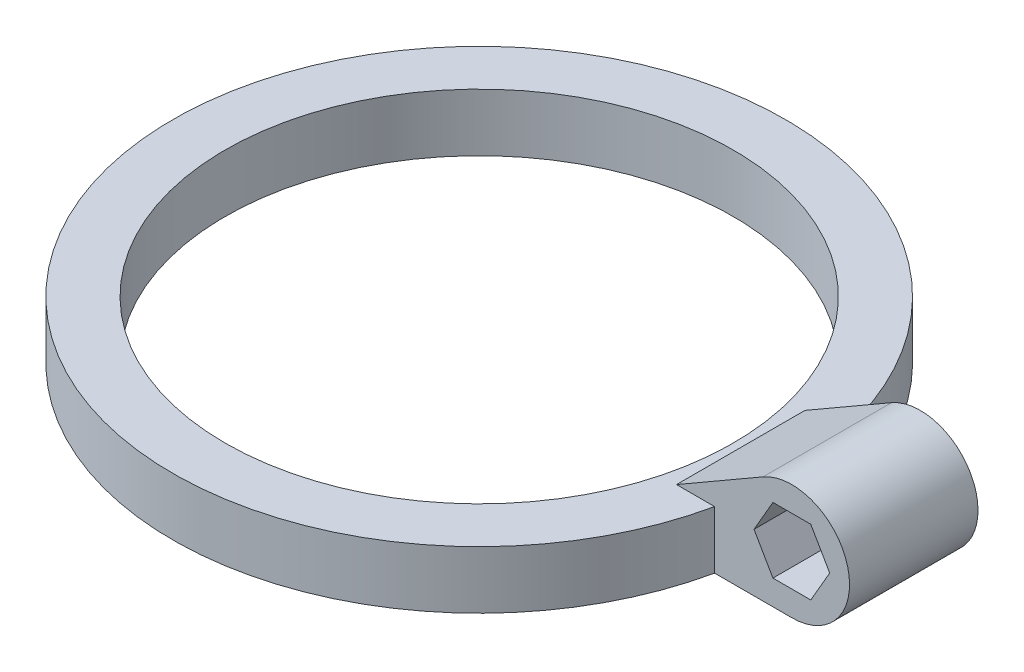
ISO-10303-21;
HEADER;
FILE_DESCRIPTION(('STEP AP214'),'2;1');
FILE_NAME('part.step','',(''),(''),'','','');
FILE_SCHEMA(('AUTOMOTIVE_DESIGN { 1 0 10303 214 1 1 1 1 }'));
ENDSEC;
DATA;
#1=APPLICATION_CONTEXT('core data for automotive mechanical design processes');
#2=APPLICATION_PROTOCOL_DEFINITION('international standard','automotive_design',2000,#1);
#3=PRODUCT_CONTEXT('',#1,'mechanical');
#4=PRODUCT('Part','Part','',(#3));
#5=PRODUCT_RELATED_PRODUCT_CATEGORY('part','',(#4));
#6=PRODUCT_DEFINITION_FORMATION('','',#4);
#7=PRODUCT_DEFINITION_CONTEXT('part definition',#1,'design');
#8=PRODUCT_DEFINITION('design','',#6,#7);
#9=PRODUCT_DEFINITION_SHAPE('','',#8);
#10=(LENGTH_UNIT() NAMED_UNIT(*) SI_UNIT(.MILLI.,.METRE.));
#11=(NAMED_UNIT(*) PLANE_ANGLE_UNIT() SI_UNIT($,.RADIAN.));
#12=(NAMED_UNIT(*) SI_UNIT($,.STERADIAN.) SOLID_ANGLE_UNIT());
#13=UNCERTAINTY_MEASURE_WITH_UNIT(LENGTH_MEASURE(1.E-05),#10,'distance_accuracy_value','');
#14=(GEOMETRIC_REPRESENTATION_CONTEXT(3) GLOBAL_UNCERTAINTY_ASSIGNED_CONTEXT((#13)) GLOBAL_UNIT_ASSIGNED_CONTEXT((#10,
#11,#12)) REPRESENTATION_CONTEXT('',''));
#15=CARTESIAN_POINT('',(0.,0.,0.));
#16=DIRECTION('',(0.,0.,1.));
#17=DIRECTION('',(1.,0.,0.));
#18=AXIS2_PLACEMENT_3D('',#15,#16,#17);
#19=CARTESIAN_POINT('',(-11.7887048969295,-8.8,-9.8));
#20=DIRECTION('',(0.,0.,-1.));
#21=DIRECTION('',(-1.,0.,0.));
#22=AXIS2_PLACEMENT_3D('',#19,#20,#21);
#23=PLANE('',#22);
#24=DIRECTION('',(0.,1.,0.));
#25=VECTOR('',#24,1.);
#26=CARTESIAN_POINT('',(1.,-5.,-9.8));
#27=LINE('',#26,#25);
#28=CARTESIAN_POINT('',(1.,-6.,-9.8));
#29=VERTEX_POINT('',#28);
#30=CARTESIAN_POINT('',(1.,-5.,-9.8));
#31=VERTEX_POINT('',#30);
#32=EDGE_CURVE('E148',#29,#31,#27,.T.);
#33=ORIENTED_EDGE('',*,*,#32,.T.);
#34=DIRECTION('',(1.,0.,0.));
#35=VECTOR('',#34,1.);
#36=CARTESIAN_POINT('',(-2.88675134594812,-5.,-9.8));
#37=LINE('',#36,#35);
#38=CARTESIAN_POINT('',(2.88675134594813,-5.,-9.8));
#39=VERTEX_POINT('',#38);
#40=EDGE_CURVE('E60',#31,#39,#37,.T.);
#41=ORIENTED_EDGE('',*,*,#40,.T.);
#42=DIRECTION('',(0.5,0.866025403784439,0.));
#43=VECTOR('',#42,1.);
#44=CARTESIAN_POINT('',(2.88675134594813,-4.99999999999999,-9.8));
#45=LINE('',#44,#43);
#46=CARTESIAN_POINT('',(5.77350269189626,0.,-9.8));
#47=VERTEX_POINT('',#46);
#48=EDGE_CURVE('E170',#39,#47,#45,.T.);
#49=ORIENTED_EDGE('',*,*,#48,.T.);
#50=DIRECTION('',(-0.5,0.866025403784438,0.));
#51=VECTOR('',#50,1.);
#52=CARTESIAN_POINT('',(5.77350269189626,0.,-9.8));
#53=LINE('',#52,#51);
#54=CARTESIAN_POINT('',(2.88675134594813,5.,-9.8));
#55=VERTEX_POINT('',#54);
#56=EDGE_CURVE('E177',#47,#55,#53,.T.);
#57=ORIENTED_EDGE('',*,*,#56,.T.);
#58=DIRECTION('',(-1.,0.,0.));
#59=VECTOR('',#58,1.);
#60=CARTESIAN_POINT('',(2.88675134594814,5.,-9.8));
#61=LINE('',#60,#59);
#62=CARTESIAN_POINT('',(-2.88675134594813,5.,-9.8));
#63=VERTEX_POINT('',#62);
#64=EDGE_CURVE('E436',#55,#63,#61,.T.);
#65=ORIENTED_EDGE('',*,*,#64,.T.);
#66=DIRECTION('',(-0.5,-0.866025403784439,0.));
#67=VECTOR('',#66,1.);
#68=CARTESIAN_POINT('',(-2.88675134594813,5.00000000000001,-9.8));
#69=LINE('',#68,#67);
#70=CARTESIAN_POINT('',(-5.77350269189626,0.,-9.8));
#71=VERTEX_POINT('',#70);
#72=EDGE_CURVE('E172',#63,#71,#69,.T.);
#73=ORIENTED_EDGE('',*,*,#72,.T.);
#74=DIRECTION('',(0.5,-0.866025403784439,0.));
#75=VECTOR('',#74,1.);
#76=CARTESIAN_POINT('',(-5.77350269189626,0.,-9.8));
#77=LINE('',#76,#75);
#78=CARTESIAN_POINT('',(-2.88675134594813,-5.,-9.8));
#79=VERTEX_POINT('',#78);
#80=EDGE_CURVE('E167',#71,#79,#77,.T.);
#81=ORIENTED_EDGE('',*,*,#80,.T.);
#82=CARTESIAN_POINT('',(-1.,-5.,-9.8));
#83=VERTEX_POINT('',#82);
#84=EDGE_CURVE('E166',#79,#83,#37,.T.);
#85=ORIENTED_EDGE('',*,*,#84,.T.);
#86=DIRECTION('',(0.,-1.,0.));
#87=VECTOR('',#86,1.);
#88=CARTESIAN_POINT('',(-0.999999999999998,-6.,-9.8));
#89=LINE('',#88,#87);
#90=CARTESIAN_POINT('',(-0.999999999999998,-6.,-9.8));
#91=VERTEX_POINT('',#90);
#92=EDGE_CURVE('E450',#83,#91,#89,.T.);
#93=ORIENTED_EDGE('',*,*,#92,.T.);
#94=DIRECTION('',(1.,0.,0.));
#95=VECTOR('',#94,1.);
#96=CARTESIAN_POINT('',(1.00000000000001,-6.,-9.8));
#97=LINE('',#96,#95);
#98=EDGE_CURVE('E160',#91,#29,#97,.T.);
#99=ORIENTED_EDGE('',*,*,#98,.T.);
#100=EDGE_LOOP('',(#33,#41,#49,#57,#65,#73,#81,#85,#93,#99));
#101=FACE_BOUND('',#100,.T.);
#102=DIRECTION('',(0.,1.,0.));
#103=VECTOR('',#102,1.);
#104=CARTESIAN_POINT('',(-11.7887048969295,-8.8,-9.79999999999999));
#105=LINE('',#104,#103);
#106=CARTESIAN_POINT('',(-11.7887048969295,-8.8,-9.79999999999999));
#107=VERTEX_POINT('',#106);
#108=CARTESIAN_POINT('',(-11.7887048969295,0.,-9.79999999999999));
#109=VERTEX_POINT('',#108);
#110=EDGE_CURVE('E41',#107,#109,#105,.T.);
#111=ORIENTED_EDGE('',*,*,#110,.T.);
#112=DIRECTION('',(1.,0.,0.));
#113=VECTOR('',#112,1.);
#114=CARTESIAN_POINT('',(0.,0.,-9.8));
#115=LINE('',#114,#113);
#116=CARTESIAN_POINT('',(-17.6000000000002,0.,-9.8));
#117=VERTEX_POINT('',#116);
#118=EDGE_CURVE('E216',#117,#109,#115,.T.);
#119=ORIENTED_EDGE('',*,*,#118,.F.);
#120=DIRECTION('',(-0.866025403784441,-0.499999999999995,0.));
#121=VECTOR('',#120,1.);
#122=CARTESIAN_POINT('',(-17.6000000000002,0.,-9.8));
#123=LINE('',#122,#121);
#124=CARTESIAN_POINT('',(-4.39999999999996,7.62102355330309,-9.8));
#125=VERTEX_POINT('',#124);
#126=EDGE_CURVE('E221',#125,#117,#123,.T.);
#127=ORIENTED_EDGE('',*,*,#126,.F.);
#128=CARTESIAN_POINT('',(0.,0.,-9.8));
#129=DIRECTION('',(0.,0.,1.));
#130=DIRECTION('',(1.,0.,0.));
#131=AXIS2_PLACEMENT_3D('',#128,#129,#130);
#132=CIRCLE('',#131,8.8);
#133=CARTESIAN_POINT('',(0.,-8.8,-9.8));
#134=VERTEX_POINT('',#133);
#135=EDGE_CURVE('E218',#134,#125,#132,.T.);
#136=ORIENTED_EDGE('',*,*,#135,.F.);
#137=DIRECTION('',(-1.,0.,0.));
#138=VECTOR('',#137,1.);
#139=CARTESIAN_POINT('',(-11.7887048969295,-8.8,-9.8));
#140=LINE('',#139,#138);
#141=EDGE_CURVE('E236',#134,#107,#140,.T.);
#142=ORIENTED_EDGE('',*,*,#141,.T.);
#143=EDGE_LOOP('',(#111,#119,#127,#136,#142));
#144=FACE_BOUND('',#143,.T.);
#145=ADVANCED_FACE('F38',(#101,#144),#23,.T.);
#146=CARTESIAN_POINT('',(-11.7887048969295,-8.8,9.8));
#147=DIRECTION('',(0.,0.,1.));
#148=DIRECTION('',(1.,0.,0.));
#149=AXIS2_PLACEMENT_3D('',#146,#147,#148);
#150=PLANE('',#149);
#151=DIRECTION('',(1.,0.,0.));
#152=VECTOR('',#151,1.);
#153=CARTESIAN_POINT('',(-11.7887048969295,-8.8,9.8));
#154=LINE('',#153,#152);
#155=CARTESIAN_POINT('',(-11.7887048969295,-8.8,9.8));
#156=VERTEX_POINT('',#155);
#157=CARTESIAN_POINT('',(0.,-8.8,9.8));
#158=VERTEX_POINT('',#157);
#159=EDGE_CURVE('E242',#156,#158,#154,.T.);
#160=ORIENTED_EDGE('',*,*,#159,.T.);
#161=CARTESIAN_POINT('',(0.,0.,9.8));
#162=DIRECTION('',(0.,0.,1.));
#163=DIRECTION('',(1.,0.,0.));
#164=AXIS2_PLACEMENT_3D('',#161,#162,#163);
#165=CIRCLE('',#164,8.8);
#166=CARTESIAN_POINT('',(-4.39999999999996,7.62102355330309,9.8));
#167=VERTEX_POINT('',#166);
#168=EDGE_CURVE('E210',#158,#167,#165,.T.);
#169=ORIENTED_EDGE('',*,*,#168,.T.);
#170=DIRECTION('',(-0.866025403784441,-0.499999999999995,0.));
#171=VECTOR('',#170,1.);
#172=CARTESIAN_POINT('',(-17.6000000000002,0.,9.8));
#173=LINE('',#172,#171);
#174=CARTESIAN_POINT('',(-17.6000000000002,0.,9.8));
#175=VERTEX_POINT('',#174);
#176=EDGE_CURVE('E213',#167,#175,#173,.T.);
#177=ORIENTED_EDGE('',*,*,#176,.T.);
#178=DIRECTION('',(1.,0.,0.));
#179=VECTOR('',#178,1.);
#180=CARTESIAN_POINT('',(0.,0.,9.8));
#181=LINE('',#180,#179);
#182=CARTESIAN_POINT('',(-11.7887048969295,0.,9.8));
#183=VERTEX_POINT('',#182);
#184=EDGE_CURVE('E207',#175,#183,#181,.T.);
#185=ORIENTED_EDGE('',*,*,#184,.T.);
#186=DIRECTION('',(0.,1.,0.));
#187=VECTOR('',#186,1.);
#188=CARTESIAN_POINT('',(-11.7887048969295,-8.8,9.8));
#189=LINE('',#188,#187);
#190=EDGE_CURVE('E11',#156,#183,#189,.T.);
#191=ORIENTED_EDGE('',*,*,#190,.F.);
#192=EDGE_LOOP('',(#160,#169,#177,#185,#191));
#193=FACE_BOUND('',#192,.T.);
#194=DIRECTION('',(-0.5,0.866025403784439,0.));
#195=VECTOR('',#194,1.);
#196=CARTESIAN_POINT('',(5.77350269189626,0.,9.8));
#197=LINE('',#196,#195);
#198=CARTESIAN_POINT('',(5.77350269189626,0.,9.8));
#199=VERTEX_POINT('',#198);
#200=CARTESIAN_POINT('',(2.88675134594813,5.,9.8));
#201=VERTEX_POINT('',#200);
#202=EDGE_CURVE('E188',#199,#201,#197,.T.);
#203=ORIENTED_EDGE('',*,*,#202,.F.);
#204=DIRECTION('',(0.5,0.866025403784439,0.));
#205=VECTOR('',#204,1.);
#206=CARTESIAN_POINT('',(2.88675134594813,-5.,9.8));
#207=LINE('',#206,#205);
#208=CARTESIAN_POINT('',(2.88675134594813,-5.,9.8));
#209=VERTEX_POINT('',#208);
#210=EDGE_CURVE('E191',#209,#199,#207,.T.);
#211=ORIENTED_EDGE('',*,*,#210,.F.);
#212=DIRECTION('',(1.,0.,0.));
#213=VECTOR('',#212,1.);
#214=CARTESIAN_POINT('',(-2.88675134594813,-5.,9.8));
#215=LINE('',#214,#213);
#216=CARTESIAN_POINT('',(-2.88675134594813,-5.,9.8));
#217=VERTEX_POINT('',#216);
#218=EDGE_CURVE('E205',#217,#209,#215,.T.);
#219=ORIENTED_EDGE('',*,*,#218,.F.);
#220=DIRECTION('',(0.5,-0.866025403784439,0.));
#221=VECTOR('',#220,1.);
#222=CARTESIAN_POINT('',(-5.77350269189626,0.,9.8));
#223=LINE('',#222,#221);
#224=CARTESIAN_POINT('',(-5.77350269189626,0.,9.8));
#225=VERTEX_POINT('',#224);
#226=EDGE_CURVE('E180',#225,#217,#223,.T.);
#227=ORIENTED_EDGE('',*,*,#226,.F.);
#228=DIRECTION('',(-0.5,-0.866025403784439,0.));
#229=VECTOR('',#228,1.);
#230=CARTESIAN_POINT('',(-2.88675134594813,5.,9.8));
#231=LINE('',#230,#229);
#232=CARTESIAN_POINT('',(-2.88675134594813,5.,9.8));
#233=VERTEX_POINT('',#232);
#234=EDGE_CURVE('E182',#233,#225,#231,.T.);
#235=ORIENTED_EDGE('',*,*,#234,.F.);
#236=DIRECTION('',(-1.,0.,0.));
#237=VECTOR('',#236,1.);
#238=CARTESIAN_POINT('',(2.88675134594813,5.,9.8));
#239=LINE('',#238,#237);
#240=EDGE_CURVE('E185',#201,#233,#239,.T.);
#241=ORIENTED_EDGE('',*,*,#240,.F.);
#242=EDGE_LOOP('',(#203,#211,#219,#227,#235,#241));
#243=FACE_BOUND('',#242,.T.);
#244=ADVANCED_FACE('F255',(#193,#243),#150,.T.);
#245=CARTESIAN_POINT('',(-57.5,0.,0.));
#246=DIRECTION('',(0.,1.,0.));
#247=DIRECTION('',(0.,0.,1.));
#248=AXIS2_PLACEMENT_3D('',#245,#246,#247);
#249=PLANE('',#248);
#250=CARTESIAN_POINT('',(-57.5,0.,0.));
#251=DIRECTION('',(0.,1.,0.));
#252=DIRECTION('',(0.,0.,1.));
#253=AXIS2_PLACEMENT_3D('',#250,#251,#252);
#254=CIRCLE('',#253,38.75);
#255=CARTESIAN_POINT('',(-57.5,0.,38.75));
#256=VERTEX_POINT('',#255);
#257=EDGE_CURVE('E228',#256,#256,#254,.T.);
#258=ORIENTED_EDGE('',*,*,#257,.F.);
#259=EDGE_LOOP('',(#258));
#260=FACE_BOUND('',#259,.T.);
#261=DIRECTION('',(0.,0.,1.));
#262=VECTOR('',#261,1.);
#263=CARTESIAN_POINT('',(-17.6000000000002,0.,-9.8));
#264=LINE('',#263,#262);
#265=EDGE_CURVE('E225',#117,#175,#264,.T.);
#266=ORIENTED_EDGE('',*,*,#265,.F.);
#267=ORIENTED_EDGE('',*,*,#118,.T.);
#268=CARTESIAN_POINT('',(-57.5,0.,0.));
#269=DIRECTION('',(0.,1.,0.));
#270=DIRECTION('',(0.,0.,1.));
#271=AXIS2_PLACEMENT_3D('',#268,#269,#270);
#272=CIRCLE('',#271,46.75);
#273=EDGE_CURVE('E233',#109,#183,#272,.T.);
#274=ORIENTED_EDGE('',*,*,#273,.T.);
#275=ORIENTED_EDGE('',*,*,#184,.F.);
#276=EDGE_LOOP('',(#266,#267,#274,#275));
#277=FACE_BOUND('',#276,.T.);
#278=ADVANCED_FACE('F250',(#260,#277),#249,.T.);
#279=CARTESIAN_POINT('',(-57.5,-8.8,0.));
#280=DIRECTION('',(0.,1.,0.));
#281=DIRECTION('',(0.,0.,1.));
#282=AXIS2_PLACEMENT_3D('',#279,#280,#281);
#283=CYLINDRICAL_SURFACE('',#282,46.75);
#284=ORIENTED_EDGE('',*,*,#273,.F.);
#285=ORIENTED_EDGE('',*,*,#110,.F.);
#286=CARTESIAN_POINT('',(-57.5,-8.8,0.));
#287=DIRECTION('',(0.,1.,0.));
#288=DIRECTION('',(0.,0.,1.));
#289=AXIS2_PLACEMENT_3D('',#286,#287,#288);
#290=CIRCLE('',#289,46.75);
#291=EDGE_CURVE('E239',#107,#156,#290,.T.);
#292=ORIENTED_EDGE('',*,*,#291,.T.);
#293=ORIENTED_EDGE('',*,*,#190,.T.);
#294=EDGE_LOOP('',(#284,#285,#292,#293));
#295=FACE_BOUND('',#294,.T.);
#296=ADVANCED_FACE('F265',(#295),#283,.T.);
#297=CARTESIAN_POINT('',(-57.5,-8.8,0.));
#298=DIRECTION('',(0.,1.,0.));
#299=DIRECTION('',(0.,0.,1.));
#300=AXIS2_PLACEMENT_3D('',#297,#298,#299);
#301=PLANE('',#300);
#302=CARTESIAN_POINT('',(-57.5,-8.8,0.));
#303=DIRECTION('',(0.,1.,0.));
#304=DIRECTION('',(0.,0.,1.));
#305=AXIS2_PLACEMENT_3D('',#302,#303,#304);
#306=CIRCLE('',#305,38.75);
#307=CARTESIAN_POINT('',(-57.5,-8.8,38.75));
#308=VERTEX_POINT('',#307);
#309=EDGE_CURVE('E230',#308,#308,#306,.T.);
#310=ORIENTED_EDGE('',*,*,#309,.T.);
#311=EDGE_LOOP('',(#310));
#312=FACE_BOUND('',#311,.T.);
#313=ORIENTED_EDGE('',*,*,#141,.F.);
#314=DIRECTION('',(0.,0.,-1.));
#315=VECTOR('',#314,1.);
#316=CARTESIAN_POINT('',(0.,-8.8,9.8));
#317=LINE('',#316,#315);
#318=EDGE_CURVE('E244',#158,#134,#317,.T.);
#319=ORIENTED_EDGE('',*,*,#318,.F.);
#320=ORIENTED_EDGE('',*,*,#159,.F.);
#321=ORIENTED_EDGE('',*,*,#291,.F.);
#322=EDGE_LOOP('',(#313,#319,#320,#321));
#323=FACE_BOUND('',#322,.T.);
#324=ADVANCED_FACE('F267',(#312,#323),#301,.F.);
#325=CARTESIAN_POINT('',(-57.5,-8.8,0.));
#326=DIRECTION('',(0.,1.,0.));
#327=DIRECTION('',(0.,0.,1.));
#328=AXIS2_PLACEMENT_3D('',#325,#326,#327);
#329=CYLINDRICAL_SURFACE('',#328,38.75);
#330=ORIENTED_EDGE('',*,*,#309,.F.);
#331=EDGE_LOOP('',(#330));
#332=FACE_BOUND('',#331,.T.);
#333=ORIENTED_EDGE('',*,*,#257,.T.);
#334=EDGE_LOOP('',(#333));
#335=FACE_BOUND('',#334,.T.);
#336=ADVANCED_FACE('F281',(#332,#335),#329,.F.);
#337=CARTESIAN_POINT('',(-17.6000000000002,0.,-9.8));
#338=DIRECTION('',(-0.499999999999995,0.866025403784441,0.));
#339=DIRECTION('',(-0.866025403784441,-0.499999999999995,0.));
#340=AXIS2_PLACEMENT_3D('',#337,#338,#339);
#341=PLANE('',#340);
#342=ORIENTED_EDGE('',*,*,#265,.T.);
#343=ORIENTED_EDGE('',*,*,#176,.F.);
#344=DIRECTION('',(0.,0.,1.));
#345=VECTOR('',#344,1.);
#346=CARTESIAN_POINT('',(-4.39999999999996,7.62102355330309,-9.8));
#347=LINE('',#346,#345);
#348=EDGE_CURVE('E224',#125,#167,#347,.T.);
#349=ORIENTED_EDGE('',*,*,#348,.F.);
#350=ORIENTED_EDGE('',*,*,#126,.T.);
#351=EDGE_LOOP('',(#342,#343,#349,#350));
#352=FACE_BOUND('',#351,.T.);
#353=ADVANCED_FACE('F261',(#352),#341,.T.);
#354=CARTESIAN_POINT('',(0.,0.,-9.8));
#355=DIRECTION('',(0.,0.,1.));
#356=DIRECTION('',(1.,0.,0.));
#357=AXIS2_PLACEMENT_3D('',#354,#355,#356);
#358=CYLINDRICAL_SURFACE('',#357,8.8);
#359=ORIENTED_EDGE('',*,*,#348,.T.);
#360=ORIENTED_EDGE('',*,*,#168,.F.);
#361=ORIENTED_EDGE('',*,*,#318,.T.);
#362=ORIENTED_EDGE('',*,*,#135,.T.);
#363=EDGE_LOOP('',(#359,#360,#361,#362));
#364=FACE_BOUND('',#363,.T.);
#365=ADVANCED_FACE('F270',(#364),#358,.T.);
#366=CARTESIAN_POINT('',(2.88675134594813,-5.,46.751));
#367=DIRECTION('',(-0.866025403784439,0.5,0.));
#368=DIRECTION('',(-0.5,-0.866025403784439,0.));
#369=AXIS2_PLACEMENT_3D('',#366,#367,#368);
#370=PLANE('',#369);
#371=ORIENTED_EDGE('',*,*,#210,.T.);
#372=DIRECTION('',(0.,0.,-1.));
#373=VECTOR('',#372,1.);
#374=CARTESIAN_POINT('',(5.77350269189626,0.,46.751));
#375=LINE('',#374,#373);
#376=EDGE_CURVE('E203',#199,#47,#375,.T.);
#377=ORIENTED_EDGE('',*,*,#376,.T.);
#378=ORIENTED_EDGE('',*,*,#48,.F.);
#379=DIRECTION('',(0.,0.,-1.));
#380=VECTOR('',#379,1.);
#381=CARTESIAN_POINT('',(2.88675134594813,-5.,46.751));
#382=LINE('',#381,#380);
#383=EDGE_CURVE('E165',#209,#39,#382,.T.);
#384=ORIENTED_EDGE('',*,*,#383,.F.);
#385=EDGE_LOOP('',(#371,#377,#378,#384));
#386=FACE_BOUND('',#385,.T.);
#387=ADVANCED_FACE('F272',(#386),#370,.T.);
#388=CARTESIAN_POINT('',(5.77350269189626,0.,46.751));
#389=DIRECTION('',(-0.866025403784438,-0.5,0.));
#390=DIRECTION('',(0.5,-0.866025403784439,0.));
#391=AXIS2_PLACEMENT_3D('',#388,#389,#390);
#392=PLANE('',#391);
#393=ORIENTED_EDGE('',*,*,#202,.T.);
#394=DIRECTION('',(0.,0.,-1.));
#395=VECTOR('',#394,1.);
#396=CARTESIAN_POINT('',(2.88675134594813,5.,46.751));
#397=LINE('',#396,#395);
#398=EDGE_CURVE('E201',#201,#55,#397,.T.);
#399=ORIENTED_EDGE('',*,*,#398,.T.);
#400=ORIENTED_EDGE('',*,*,#56,.F.);
#401=ORIENTED_EDGE('',*,*,#376,.F.);
#402=EDGE_LOOP('',(#393,#399,#400,#401));
#403=FACE_BOUND('',#402,.T.);
#404=ADVANCED_FACE('F278',(#403),#392,.T.);
#405=CARTESIAN_POINT('',(2.88675134594813,5.,46.751));
#406=DIRECTION('',(0.,-1.,0.));
#407=DIRECTION('',(0.,0.,-1.));
#408=AXIS2_PLACEMENT_3D('',#405,#406,#407);
#409=PLANE('',#408);
#410=ORIENTED_EDGE('',*,*,#240,.T.);
#411=DIRECTION('',(0.,0.,-1.));
#412=VECTOR('',#411,1.);
#413=CARTESIAN_POINT('',(-2.88675134594813,5.,46.751));
#414=LINE('',#413,#412);
#415=EDGE_CURVE('E199',#233,#63,#414,.T.);
#416=ORIENTED_EDGE('',*,*,#415,.T.);
#417=ORIENTED_EDGE('',*,*,#64,.F.);
#418=ORIENTED_EDGE('',*,*,#398,.F.);
#419=EDGE_LOOP('',(#410,#416,#417,#418));
#420=FACE_BOUND('',#419,.T.);
#421=ADVANCED_FACE('F343',(#420),#409,.T.);
#422=CARTESIAN_POINT('',(-2.88675134594813,5.,46.751));
#423=DIRECTION('',(0.866025403784438,-0.5,0.));
#424=DIRECTION('',(0.5,0.866025403784439,0.));
#425=AXIS2_PLACEMENT_3D('',#422,#423,#424);
#426=PLANE('',#425);
#427=ORIENTED_EDGE('',*,*,#234,.T.);
#428=DIRECTION('',(0.,0.,-1.));
#429=VECTOR('',#428,1.);
#430=CARTESIAN_POINT('',(-5.77350269189626,0.,46.751));
#431=LINE('',#430,#429);
#432=EDGE_CURVE('E197',#225,#71,#431,.T.);
#433=ORIENTED_EDGE('',*,*,#432,.T.);
#434=ORIENTED_EDGE('',*,*,#72,.F.);
#435=ORIENTED_EDGE('',*,*,#415,.F.);
#436=EDGE_LOOP('',(#427,#433,#434,#435));
#437=FACE_BOUND('',#436,.T.);
#438=ADVANCED_FACE('F353',(#437),#426,.T.);
#439=CARTESIAN_POINT('',(-5.77350269189626,0.,46.751));
#440=DIRECTION('',(0.866025403784438,0.5,0.));
#441=DIRECTION('',(-0.5,0.866025403784439,0.));
#442=AXIS2_PLACEMENT_3D('',#439,#440,#441);
#443=PLANE('',#442);
#444=ORIENTED_EDGE('',*,*,#226,.T.);
#445=DIRECTION('',(0.,0.,-1.));
#446=VECTOR('',#445,1.);
#447=CARTESIAN_POINT('',(-2.88675134594813,-5.,46.751));
#448=LINE('',#447,#446);
#449=EDGE_CURVE('E195',#217,#79,#448,.T.);
#450=ORIENTED_EDGE('',*,*,#449,.T.);
#451=ORIENTED_EDGE('',*,*,#80,.F.);
#452=ORIENTED_EDGE('',*,*,#432,.F.);
#453=EDGE_LOOP('',(#444,#450,#451,#452));
#454=FACE_BOUND('',#453,.T.);
#455=ADVANCED_FACE('F363',(#454),#443,.T.);
#456=CARTESIAN_POINT('',(-2.88675134594813,-5.,46.751));
#457=DIRECTION('',(0.,1.,0.));
#458=DIRECTION('',(-1.,0.,0.));
#459=AXIS2_PLACEMENT_3D('',#456,#457,#458);
#460=PLANE('',#459);
#461=DIRECTION('',(0.,0.,1.));
#462=VECTOR('',#461,1.);
#463=CARTESIAN_POINT('',(1.,-5.,-46.751));
#464=LINE('',#463,#462);
#465=CARTESIAN_POINT('',(1.,-5.,0.));
#466=VERTEX_POINT('',#465);
#467=EDGE_CURVE('E146',#31,#466,#464,.T.);
#468=ORIENTED_EDGE('',*,*,#467,.T.);
#469=DIRECTION('',(-1.,0.,0.));
#470=VECTOR('',#469,1.);
#471=CARTESIAN_POINT('',(-1.,-5.,0.));
#472=LINE('',#471,#470);
#473=CARTESIAN_POINT('',(-1.,-5.,0.));
#474=VERTEX_POINT('',#473);
#475=EDGE_CURVE('E426',#466,#474,#472,.T.);
#476=ORIENTED_EDGE('',*,*,#475,.T.);
#477=DIRECTION('',(0.,0.,1.));
#478=VECTOR('',#477,1.);
#479=CARTESIAN_POINT('',(-1.,-5.,-46.751));
#480=LINE('',#479,#478);
#481=EDGE_CURVE('E154',#83,#474,#480,.T.);
#482=ORIENTED_EDGE('',*,*,#481,.F.);
#483=ORIENTED_EDGE('',*,*,#84,.F.);
#484=ORIENTED_EDGE('',*,*,#449,.F.);
#485=ORIENTED_EDGE('',*,*,#218,.T.);
#486=ORIENTED_EDGE('',*,*,#383,.T.);
#487=ORIENTED_EDGE('',*,*,#40,.F.);
#488=EDGE_LOOP('',(#468,#476,#482,#483,#484,#485,#486,#487));
#489=FACE_BOUND('',#488,.T.);
#490=ADVANCED_FACE('F163',(#489),#460,.T.);
#491=CARTESIAN_POINT('',(1.,-5.,-46.751));
#492=DIRECTION('',(1.,0.,0.));
#493=DIRECTION('',(0.,0.,-1.));
#494=AXIS2_PLACEMENT_3D('',#491,#492,#493);
#495=PLANE('',#494);
#496=DIRECTION('',(0.,0.,1.));
#497=VECTOR('',#496,1.);
#498=CARTESIAN_POINT('',(1.,-6.,-46.751));
#499=LINE('',#498,#497);
#500=CARTESIAN_POINT('',(1.,-6.,0.));
#501=VERTEX_POINT('',#500);
#502=EDGE_CURVE('E428',#29,#501,#499,.T.);
#503=ORIENTED_EDGE('',*,*,#502,.T.);
#504=DIRECTION('',(0.,1.,0.));
#505=VECTOR('',#504,1.);
#506=CARTESIAN_POINT('',(1.,-5.,0.));
#507=LINE('',#506,#505);
#508=EDGE_CURVE('E151',#501,#466,#507,.T.);
#509=ORIENTED_EDGE('',*,*,#508,.T.);
#510=ORIENTED_EDGE('',*,*,#467,.F.);
#511=ORIENTED_EDGE('',*,*,#32,.F.);
#512=EDGE_LOOP('',(#503,#509,#510,#511));
#513=FACE_BOUND('',#512,.T.);
#514=ADVANCED_FACE('F147',(#513),#495,.F.);
#515=CARTESIAN_POINT('',(1.,-6.,-46.751));
#516=DIRECTION('',(0.,-1.,0.));
#517=DIRECTION('',(1.,0.,0.));
#518=AXIS2_PLACEMENT_3D('',#515,#516,#517);
#519=PLANE('',#518);
#520=DIRECTION('',(0.,0.,1.));
#521=VECTOR('',#520,1.);
#522=CARTESIAN_POINT('',(-0.999999999999998,-6.,-46.751));
#523=LINE('',#522,#521);
#524=CARTESIAN_POINT('',(-0.999999999999998,-6.,0.));
#525=VERTEX_POINT('',#524);
#526=EDGE_CURVE('E430',#91,#525,#523,.T.);
#527=ORIENTED_EDGE('',*,*,#526,.T.);
#528=DIRECTION('',(1.,0.,0.));
#529=VECTOR('',#528,1.);
#530=CARTESIAN_POINT('',(1.,-6.,0.));
#531=LINE('',#530,#529);
#532=EDGE_CURVE('E155',#525,#501,#531,.T.);
#533=ORIENTED_EDGE('',*,*,#532,.T.);
#534=ORIENTED_EDGE('',*,*,#502,.F.);
#535=ORIENTED_EDGE('',*,*,#98,.F.);
#536=EDGE_LOOP('',(#527,#533,#534,#535));
#537=FACE_BOUND('',#536,.T.);
#538=ADVANCED_FACE('F393',(#537),#519,.F.);
#539=CARTESIAN_POINT('',(-0.999999999999998,-6.,-46.751));
#540=DIRECTION('',(-1.,0.,0.));
#541=DIRECTION('',(0.,-1.,0.));
#542=AXIS2_PLACEMENT_3D('',#539,#540,#541);
#543=PLANE('',#542);
#544=ORIENTED_EDGE('',*,*,#481,.T.);
#545=DIRECTION('',(0.,-1.,0.));
#546=VECTOR('',#545,1.);
#547=CARTESIAN_POINT('',(-0.999999999999998,-6.,0.));
#548=LINE('',#547,#546);
#549=EDGE_CURVE('E52',#474,#525,#548,.T.);
#550=ORIENTED_EDGE('',*,*,#549,.T.);
#551=ORIENTED_EDGE('',*,*,#526,.F.);
#552=ORIENTED_EDGE('',*,*,#92,.F.);
#553=EDGE_LOOP('',(#544,#550,#551,#552));
#554=FACE_BOUND('',#553,.T.);
#555=ADVANCED_FACE('F402',(#554),#543,.F.);
#556=CARTESIAN_POINT('',(0.,0.,0.));
#557=DIRECTION('',(0.,0.,-1.));
#558=DIRECTION('',(-1.,0.,0.));
#559=AXIS2_PLACEMENT_3D('',#556,#557,#558);
#560=PLANE('',#559);
#561=ORIENTED_EDGE('',*,*,#508,.F.);
#562=ORIENTED_EDGE('',*,*,#532,.F.);
#563=ORIENTED_EDGE('',*,*,#549,.F.);
#564=ORIENTED_EDGE('',*,*,#475,.F.);
#565=EDGE_LOOP('',(#561,#562,#563,#564));
#566=FACE_BOUND('',#565,.T.);
#567=ADVANCED_FACE('F412',(#566),#560,.T.);
#568=CLOSED_SHELL('',(#145,#244,#278,#296,#324,#336,#353,#365,#387,#404,#421,#438,#455,#490,
#514,#538,#555,#567));
#569=MANIFOLD_SOLID_BREP('B2',#568);
#570=ADVANCED_BREP_SHAPE_REPRESENTATION('',(#18,#569),#14);
#571=SHAPE_DEFINITION_REPRESENTATION(#9,#570);
ENDSEC;
END-ISO-10303-21;
